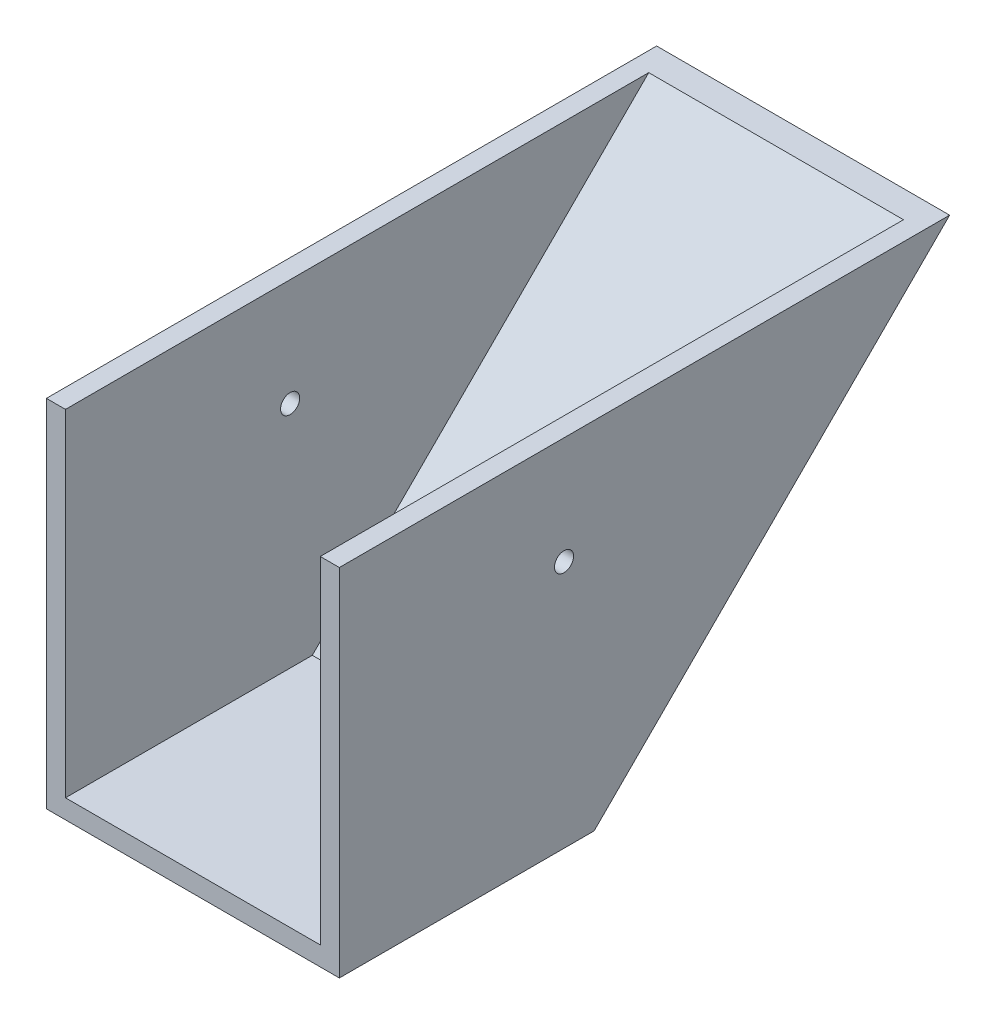
ISO-10303-21;
HEADER;
FILE_DESCRIPTION(('STEP AP214'),'2;1');
FILE_NAME('part.step','',(''),(''),'','','');
FILE_SCHEMA(('AUTOMOTIVE_DESIGN { 1 0 10303 214 1 1 1 1 }'));
ENDSEC;
DATA;
#1=APPLICATION_CONTEXT('core data for automotive mechanical design processes');
#2=APPLICATION_PROTOCOL_DEFINITION('international standard','automotive_design',2000,#1);
#3=PRODUCT_CONTEXT('',#1,'mechanical');
#4=PRODUCT('Part','Part','',(#3));
#5=PRODUCT_RELATED_PRODUCT_CATEGORY('part','',(#4));
#6=PRODUCT_DEFINITION_FORMATION('','',#4);
#7=PRODUCT_DEFINITION_CONTEXT('part definition',#1,'design');
#8=PRODUCT_DEFINITION('design','',#6,#7);
#9=PRODUCT_DEFINITION_SHAPE('','',#8);
#10=(LENGTH_UNIT() NAMED_UNIT(*) SI_UNIT(.MILLI.,.METRE.));
#11=(NAMED_UNIT(*) PLANE_ANGLE_UNIT() SI_UNIT($,.RADIAN.));
#12=(NAMED_UNIT(*) SI_UNIT($,.STERADIAN.) SOLID_ANGLE_UNIT());
#13=UNCERTAINTY_MEASURE_WITH_UNIT(LENGTH_MEASURE(1.E-05),#10,'distance_accuracy_value','');
#14=(GEOMETRIC_REPRESENTATION_CONTEXT(3) GLOBAL_UNCERTAINTY_ASSIGNED_CONTEXT((#13)) GLOBAL_UNIT_ASSIGNED_CONTEXT((#10,
#11,#12)) REPRESENTATION_CONTEXT('',''));
#15=CARTESIAN_POINT('',(0.,0.,0.));
#16=DIRECTION('',(0.,0.,1.));
#17=DIRECTION('',(1.,0.,0.));
#18=AXIS2_PLACEMENT_3D('',#15,#16,#17);
#19=CARTESIAN_POINT('',(-146.05,190.5,317.5));
#20=DIRECTION('',(0.,0.,-1.));
#21=DIRECTION('',(-1.,0.,0.));
#22=AXIS2_PLACEMENT_3D('',#19,#20,#21);
#23=PLANE('',#22);
#24=DIRECTION('',(1.,0.,0.));
#25=VECTOR('',#24,1.);
#26=CARTESIAN_POINT('',(-146.05,163.914666666667,317.5));
#27=LINE('',#26,#25);
#28=CARTESIAN_POINT('',(-146.05,163.914666666667,317.5));
#29=VERTEX_POINT('',#28);
#30=CARTESIAN_POINT('',(-127.,163.914666666667,317.5));
#31=VERTEX_POINT('',#30);
#32=EDGE_CURVE('E102',#29,#31,#27,.T.);
#33=ORIENTED_EDGE('',*,*,#32,.F.);
#34=DIRECTION('',(0.,-1.,0.));
#35=VECTOR('',#34,1.);
#36=CARTESIAN_POINT('',(-146.05,190.5,317.5));
#37=LINE('',#36,#35);
#38=CARTESIAN_POINT('',(-146.05,-190.5,317.5));
#39=VERTEX_POINT('',#38);
#40=EDGE_CURVE('E113',#29,#39,#37,.T.);
#41=ORIENTED_EDGE('',*,*,#40,.T.);
#42=DIRECTION('',(1.,0.,0.));
#43=VECTOR('',#42,1.);
#44=CARTESIAN_POINT('',(-146.05,-190.5,317.5));
#45=LINE('',#44,#43);
#46=CARTESIAN_POINT('',(146.05,-190.5,317.5));
#47=VERTEX_POINT('',#46);
#48=EDGE_CURVE('E126',#39,#47,#45,.T.);
#49=ORIENTED_EDGE('',*,*,#48,.T.);
#50=DIRECTION('',(0.,-1.,0.));
#51=VECTOR('',#50,1.);
#52=CARTESIAN_POINT('',(146.05,190.5,317.5));
#53=LINE('',#52,#51);
#54=CARTESIAN_POINT('',(146.05,163.914666666667,317.5));
#55=VERTEX_POINT('',#54);
#56=EDGE_CURVE('E123',#55,#47,#53,.T.);
#57=ORIENTED_EDGE('',*,*,#56,.F.);
#58=CARTESIAN_POINT('',(127.,163.914666666667,317.5));
#59=VERTEX_POINT('',#58);
#60=EDGE_CURVE('E108',#59,#55,#27,.T.);
#61=ORIENTED_EDGE('',*,*,#60,.F.);
#62=DIRECTION('',(0.,-1.,0.));
#63=VECTOR('',#62,1.);
#64=CARTESIAN_POINT('',(127.,190.5,317.5));
#65=LINE('',#64,#63);
#66=CARTESIAN_POINT('',(127.,-171.45,317.5));
#67=VERTEX_POINT('',#66);
#68=EDGE_CURVE('E164',#59,#67,#65,.T.);
#69=ORIENTED_EDGE('',*,*,#68,.T.);
#70=DIRECTION('',(1.,0.,0.));
#71=VECTOR('',#70,1.);
#72=CARTESIAN_POINT('',(0.,-171.45,317.5));
#73=LINE('',#72,#71);
#74=CARTESIAN_POINT('',(-127.,-171.45,317.5));
#75=VERTEX_POINT('',#74);
#76=EDGE_CURVE('E160',#75,#67,#73,.T.);
#77=ORIENTED_EDGE('',*,*,#76,.F.);
#78=DIRECTION('',(0.,-1.,0.));
#79=VECTOR('',#78,1.);
#80=CARTESIAN_POINT('',(-127.,190.5,317.5));
#81=LINE('',#80,#79);
#82=EDGE_CURVE('E116',#31,#75,#81,.T.);
#83=ORIENTED_EDGE('',*,*,#82,.F.);
#84=EDGE_LOOP('',(#33,#41,#49,#57,#61,#69,#77,#83));
#85=FACE_BOUND('',#84,.T.);
#86=ADVANCED_FACE('F36',(#85),#23,.F.);
#87=CARTESIAN_POINT('',(146.05,190.5,317.5));
#88=DIRECTION('',(-1.,0.,0.));
#89=DIRECTION('',(0.,0.,1.));
#90=AXIS2_PLACEMENT_3D('',#87,#88,#89);
#91=PLANE('',#90);
#92=CARTESIAN_POINT('',(146.05,56.9612089146503,93.5172925237751));
#93=DIRECTION('',(-1.,0.,0.));
#94=DIRECTION('',(0.,0.,1.));
#95=AXIS2_PLACEMENT_3D('',#92,#93,#94);
#96=CIRCLE('',#95,9.52500000000001);
#97=CARTESIAN_POINT('',(146.05,56.9612089146503,103.042292523775));
#98=VERTEX_POINT('',#97);
#99=EDGE_CURVE('E136',#98,#98,#96,.T.);
#100=ORIENTED_EDGE('',*,*,#99,.T.);
#101=EDGE_LOOP('',(#100));
#102=FACE_BOUND('',#101,.T.);
#103=DIRECTION('',(0.,0.,-1.));
#104=VECTOR('',#103,1.);
#105=CARTESIAN_POINT('',(146.05,163.914666666667,-292.608));
#106=LINE('',#105,#104);
#107=CARTESIAN_POINT('',(146.05,163.914666666667,-290.914666666667));
#108=VERTEX_POINT('',#107);
#109=EDGE_CURVE('E117',#55,#108,#106,.T.);
#110=ORIENTED_EDGE('',*,*,#109,.F.);
#111=ORIENTED_EDGE('',*,*,#56,.T.);
#112=DIRECTION('',(0.,0.,-1.));
#113=VECTOR('',#112,1.);
#114=CARTESIAN_POINT('',(146.05,-190.5,317.5));
#115=LINE('',#114,#113);
#116=CARTESIAN_POINT('',(146.05,-190.5,63.5000000000015));
#117=VERTEX_POINT('',#116);
#118=EDGE_CURVE('E171',#47,#117,#115,.T.);
#119=ORIENTED_EDGE('',*,*,#118,.T.);
#120=DIRECTION('',(0.,0.707106781186546,-0.707106781186549));
#121=VECTOR('',#120,1.);
#122=CARTESIAN_POINT('',(146.05,-127.,1.16573417585641E-12));
#123=LINE('',#122,#121);
#124=EDGE_CURVE('E58',#117,#108,#123,.T.);
#125=ORIENTED_EDGE('',*,*,#124,.T.);
#126=EDGE_LOOP('',(#110,#111,#119,#125));
#127=FACE_BOUND('',#126,.T.);
#128=ADVANCED_FACE('F38',(#102,#127),#91,.F.);
#129=CARTESIAN_POINT('',(-146.05,190.5,317.5));
#130=DIRECTION('',(1.,0.,0.));
#131=DIRECTION('',(0.,0.,-1.));
#132=AXIS2_PLACEMENT_3D('',#129,#130,#131);
#133=PLANE('',#132);
#134=CARTESIAN_POINT('',(-146.05,56.9612089146503,93.5172925237751));
#135=DIRECTION('',(-1.,0.,0.));
#136=DIRECTION('',(0.,0.,1.));
#137=AXIS2_PLACEMENT_3D('',#134,#135,#136);
#138=CIRCLE('',#137,9.52500000000001);
#139=CARTESIAN_POINT('',(-146.05,56.9612089146503,103.042292523775));
#140=VERTEX_POINT('',#139);
#141=EDGE_CURVE('E132',#140,#140,#138,.T.);
#142=ORIENTED_EDGE('',*,*,#141,.F.);
#143=EDGE_LOOP('',(#142));
#144=FACE_BOUND('',#143,.T.);
#145=DIRECTION('',(0.,0.,1.));
#146=VECTOR('',#145,1.);
#147=CARTESIAN_POINT('',(-146.05,163.914666666667,-292.608));
#148=LINE('',#147,#146);
#149=CARTESIAN_POINT('',(-146.05,163.914666666667,-290.914666666667));
#150=VERTEX_POINT('',#149);
#151=EDGE_CURVE('E99',#150,#29,#148,.T.);
#152=ORIENTED_EDGE('',*,*,#151,.F.);
#153=DIRECTION('',(0.,0.707106781186546,-0.707106781186549));
#154=VECTOR('',#153,1.);
#155=CARTESIAN_POINT('',(-146.05,190.5,-317.5));
#156=LINE('',#155,#154);
#157=CARTESIAN_POINT('',(-146.05,-190.5,63.5000000000013));
#158=VERTEX_POINT('',#157);
#159=EDGE_CURVE('E163',#158,#150,#156,.T.);
#160=ORIENTED_EDGE('',*,*,#159,.F.);
#161=DIRECTION('',(0.,0.,1.));
#162=VECTOR('',#161,1.);
#163=CARTESIAN_POINT('',(-146.05,-190.5,317.5));
#164=LINE('',#163,#162);
#165=EDGE_CURVE('E121',#158,#39,#164,.T.);
#166=ORIENTED_EDGE('',*,*,#165,.T.);
#167=ORIENTED_EDGE('',*,*,#40,.F.);
#168=EDGE_LOOP('',(#152,#160,#166,#167));
#169=FACE_BOUND('',#168,.T.);
#170=ADVANCED_FACE('F119',(#144,#169),#133,.F.);
#171=CARTESIAN_POINT('',(234.95,190.5,-317.5));
#172=DIRECTION('',(0.,0.707106781186549,0.707106781186546));
#173=DIRECTION('',(0.,-0.707106781186546,0.707106781186549));
#174=AXIS2_PLACEMENT_3D('',#171,#172,#173);
#175=PLANE('',#174);
#176=DIRECTION('',(-1.,0.,0.));
#177=VECTOR('',#176,1.);
#178=CARTESIAN_POINT('',(234.95,163.914666666667,-290.914666666667));
#179=LINE('',#178,#177);
#180=EDGE_CURVE('E103',#108,#150,#179,.T.);
#181=ORIENTED_EDGE('',*,*,#180,.F.);
#182=ORIENTED_EDGE('',*,*,#124,.F.);
#183=DIRECTION('',(-1.,0.,0.));
#184=VECTOR('',#183,1.);
#185=CARTESIAN_POINT('',(0.,-190.5,63.5000000000014));
#186=LINE('',#185,#184);
#187=EDGE_CURVE('E44',#117,#158,#186,.T.);
#188=ORIENTED_EDGE('',*,*,#187,.T.);
#189=ORIENTED_EDGE('',*,*,#159,.T.);
#190=EDGE_LOOP('',(#181,#182,#188,#189));
#191=FACE_BOUND('',#190,.T.);
#192=ADVANCED_FACE('F205',(#191),#175,.F.);
#193=CARTESIAN_POINT('',(127.,190.5,317.5));
#194=DIRECTION('',(-1.,0.,0.));
#195=DIRECTION('',(0.,0.,1.));
#196=AXIS2_PLACEMENT_3D('',#193,#194,#195);
#197=PLANE('',#196);
#198=CARTESIAN_POINT('',(127.,56.9612089146503,93.5172925237751));
#199=DIRECTION('',(-1.,0.,0.));
#200=DIRECTION('',(0.,0.,1.));
#201=AXIS2_PLACEMENT_3D('',#198,#199,#200);
#202=CIRCLE('',#201,9.52500000000001);
#203=CARTESIAN_POINT('',(127.,56.9612089146503,103.042292523775));
#204=VERTEX_POINT('',#203);
#205=EDGE_CURVE('E131',#204,#204,#202,.T.);
#206=ORIENTED_EDGE('',*,*,#205,.F.);
#207=EDGE_LOOP('',(#206));
#208=FACE_BOUND('',#207,.T.);
#209=ORIENTED_EDGE('',*,*,#68,.F.);
#210=DIRECTION('',(0.,0.,-1.));
#211=VECTOR('',#210,1.);
#212=CARTESIAN_POINT('',(127.,163.914666666667,317.5));
#213=LINE('',#212,#211);
#214=CARTESIAN_POINT('',(127.,163.914666666667,-263.973898303459));
#215=VERTEX_POINT('',#214);
#216=EDGE_CURVE('E142',#59,#215,#213,.T.);
#217=ORIENTED_EDGE('',*,*,#216,.T.);
#218=DIRECTION('',(0.,0.707106781186546,-0.707106781186549));
#219=VECTOR('',#218,1.);
#220=CARTESIAN_POINT('',(127.,-113.529615818396,13.4703841816049));
#221=LINE('',#220,#219);
#222=CARTESIAN_POINT('',(127.,-171.45,71.3907683632088));
#223=VERTEX_POINT('',#222);
#224=EDGE_CURVE('E153',#223,#215,#221,.T.);
#225=ORIENTED_EDGE('',*,*,#224,.F.);
#226=DIRECTION('',(0.,0.,-1.));
#227=VECTOR('',#226,1.);
#228=CARTESIAN_POINT('',(127.,-171.45,0.));
#229=LINE('',#228,#227);
#230=EDGE_CURVE('E149',#67,#223,#229,.T.);
#231=ORIENTED_EDGE('',*,*,#230,.F.);
#232=EDGE_LOOP('',(#209,#217,#225,#231));
#233=FACE_BOUND('',#232,.T.);
#234=ADVANCED_FACE('F186',(#208,#233),#197,.T.);
#235=CARTESIAN_POINT('',(-127.,190.5,317.5));
#236=DIRECTION('',(1.,0.,0.));
#237=DIRECTION('',(0.,0.,-1.));
#238=AXIS2_PLACEMENT_3D('',#235,#236,#237);
#239=PLANE('',#238);
#240=CARTESIAN_POINT('',(-127.,56.9612089146503,93.5172925237751));
#241=DIRECTION('',(1.,0.,0.));
#242=DIRECTION('',(0.,0.,-1.));
#243=AXIS2_PLACEMENT_3D('',#240,#241,#242);
#244=CIRCLE('',#243,9.52500000000001);
#245=CARTESIAN_POINT('',(-127.,56.9612089146503,83.9922925237751));
#246=VERTEX_POINT('',#245);
#247=EDGE_CURVE('E129',#246,#246,#244,.T.);
#248=ORIENTED_EDGE('',*,*,#247,.F.);
#249=EDGE_LOOP('',(#248));
#250=FACE_BOUND('',#249,.T.);
#251=DIRECTION('',(0.,0.707106781186546,-0.707106781186549));
#252=VECTOR('',#251,1.);
#253=CARTESIAN_POINT('',(-127.,203.970384181604,-304.029615818396));
#254=LINE('',#253,#252);
#255=CARTESIAN_POINT('',(-127.,-171.45,71.3907683632088));
#256=VERTEX_POINT('',#255);
#257=CARTESIAN_POINT('',(-127.,163.914666666667,-263.973898303459));
#258=VERTEX_POINT('',#257);
#259=EDGE_CURVE('E148',#256,#258,#254,.T.);
#260=ORIENTED_EDGE('',*,*,#259,.T.);
#261=DIRECTION('',(0.,0.,1.));
#262=VECTOR('',#261,1.);
#263=CARTESIAN_POINT('',(-127.,163.914666666667,317.5));
#264=LINE('',#263,#262);
#265=EDGE_CURVE('E51',#258,#31,#264,.T.);
#266=ORIENTED_EDGE('',*,*,#265,.T.);
#267=ORIENTED_EDGE('',*,*,#82,.T.);
#268=DIRECTION('',(0.,0.,1.));
#269=VECTOR('',#268,1.);
#270=CARTESIAN_POINT('',(-127.,-171.45,0.));
#271=LINE('',#270,#269);
#272=EDGE_CURVE('E152',#256,#75,#271,.T.);
#273=ORIENTED_EDGE('',*,*,#272,.F.);
#274=EDGE_LOOP('',(#260,#266,#267,#273));
#275=FACE_BOUND('',#274,.T.);
#276=ADVANCED_FACE('F196',(#250,#275),#239,.T.);
#277=CARTESIAN_POINT('',(234.95,203.970384181604,-304.029615818396));
#278=DIRECTION('',(0.,0.707106781186549,0.707106781186546));
#279=DIRECTION('',(0.,-0.707106781186546,0.707106781186549));
#280=AXIS2_PLACEMENT_3D('',#277,#278,#279);
#281=PLANE('',#280);
#282=ORIENTED_EDGE('',*,*,#224,.T.);
#283=DIRECTION('',(-1.,0.,0.));
#284=VECTOR('',#283,1.);
#285=CARTESIAN_POINT('',(234.95,163.914666666667,-263.973898303459));
#286=LINE('',#285,#284);
#287=EDGE_CURVE('E11',#215,#258,#286,.T.);
#288=ORIENTED_EDGE('',*,*,#287,.T.);
#289=ORIENTED_EDGE('',*,*,#259,.F.);
#290=DIRECTION('',(-1.,0.,0.));
#291=VECTOR('',#290,1.);
#292=CARTESIAN_POINT('',(0.,-171.45,71.3907683632088));
#293=LINE('',#292,#291);
#294=EDGE_CURVE('E161',#223,#256,#293,.T.);
#295=ORIENTED_EDGE('',*,*,#294,.F.);
#296=EDGE_LOOP('',(#282,#288,#289,#295));
#297=FACE_BOUND('',#296,.T.);
#298=ADVANCED_FACE('F190',(#297),#281,.T.);
#299=CARTESIAN_POINT('',(0.,-190.5,0.));
#300=DIRECTION('',(0.,-1.,0.));
#301=DIRECTION('',(0.,0.,-1.));
#302=AXIS2_PLACEMENT_3D('',#299,#300,#301);
#303=PLANE('',#302);
#304=ORIENTED_EDGE('',*,*,#187,.F.);
#305=ORIENTED_EDGE('',*,*,#118,.F.);
#306=ORIENTED_EDGE('',*,*,#48,.F.);
#307=ORIENTED_EDGE('',*,*,#165,.F.);
#308=EDGE_LOOP('',(#304,#305,#306,#307));
#309=FACE_BOUND('',#308,.T.);
#310=ADVANCED_FACE('F178',(#309),#303,.T.);
#311=CARTESIAN_POINT('',(0.,-171.45,0.));
#312=DIRECTION('',(0.,-1.,0.));
#313=DIRECTION('',(0.,0.,-1.));
#314=AXIS2_PLACEMENT_3D('',#311,#312,#313);
#315=PLANE('',#314);
#316=ORIENTED_EDGE('',*,*,#294,.T.);
#317=ORIENTED_EDGE('',*,*,#272,.T.);
#318=ORIENTED_EDGE('',*,*,#76,.T.);
#319=ORIENTED_EDGE('',*,*,#230,.T.);
#320=EDGE_LOOP('',(#316,#317,#318,#319));
#321=FACE_BOUND('',#320,.T.);
#322=ADVANCED_FACE('F194',(#321),#315,.F.);
#323=CARTESIAN_POINT('',(368.046000000001,56.9612089146503,93.5172925237751));
#324=DIRECTION('',(-1.,0.,0.));
#325=DIRECTION('',(0.,0.,1.));
#326=AXIS2_PLACEMENT_3D('',#323,#324,#325);
#327=CYLINDRICAL_SURFACE('',#326,9.52500000000001);
#328=ORIENTED_EDGE('',*,*,#247,.T.);
#329=EDGE_LOOP('',(#328));
#330=FACE_BOUND('',#329,.T.);
#331=ORIENTED_EDGE('',*,*,#141,.T.);
#332=EDGE_LOOP('',(#331));
#333=FACE_BOUND('',#332,.T.);
#334=ADVANCED_FACE('F225',(#330,#333),#327,.F.);
#335=ORIENTED_EDGE('',*,*,#205,.T.);
#336=EDGE_LOOP('',(#335));
#337=FACE_BOUND('',#336,.T.);
#338=ORIENTED_EDGE('',*,*,#99,.F.);
#339=EDGE_LOOP('',(#338));
#340=FACE_BOUND('',#339,.T.);
#341=ADVANCED_FACE('F230',(#337,#340),#327,.F.);
#342=CARTESIAN_POINT('',(0.,163.914666666667,0.));
#343=DIRECTION('',(0.,1.,0.));
#344=DIRECTION('',(0.,0.,1.));
#345=AXIS2_PLACEMENT_3D('',#342,#343,#344);
#346=PLANE('',#345);
#347=ORIENTED_EDGE('',*,*,#180,.T.);
#348=ORIENTED_EDGE('',*,*,#151,.T.);
#349=ORIENTED_EDGE('',*,*,#32,.T.);
#350=ORIENTED_EDGE('',*,*,#265,.F.);
#351=ORIENTED_EDGE('',*,*,#287,.F.);
#352=ORIENTED_EDGE('',*,*,#216,.F.);
#353=ORIENTED_EDGE('',*,*,#60,.T.);
#354=ORIENTED_EDGE('',*,*,#109,.T.);
#355=EDGE_LOOP('',(#347,#348,#349,#350,#351,#352,#353,#354));
#356=FACE_BOUND('',#355,.T.);
#357=ADVANCED_FACE('F101',(#356),#346,.T.);
#358=CLOSED_SHELL('',(#86,#128,#170,#192,#234,#276,#298,#310,#322,#334,#341,#357));
#359=MANIFOLD_SOLID_BREP('B2',#358);
#360=ADVANCED_BREP_SHAPE_REPRESENTATION('',(#18,#359),#14);
#361=SHAPE_DEFINITION_REPRESENTATION(#9,#360);
ENDSEC;
END-ISO-10303-21;
